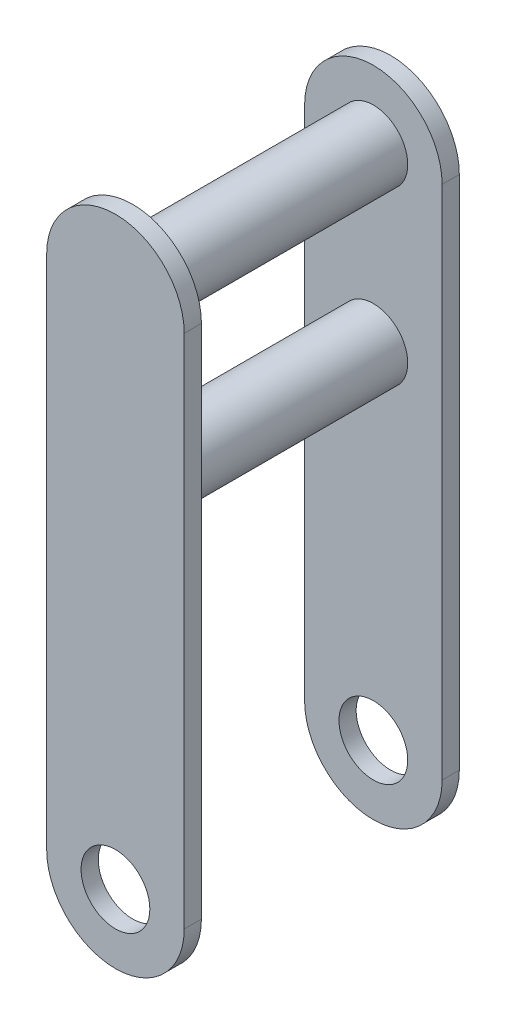
ISO-10303-21;
HEADER;
FILE_DESCRIPTION(('STEP AP214'),'2;1');
FILE_NAME('part.step','',(''),(''),'','','');
FILE_SCHEMA(('AUTOMOTIVE_DESIGN { 1 0 10303 214 1 1 1 1 }'));
ENDSEC;
DATA;
#1=APPLICATION_CONTEXT('core data for automotive mechanical design processes');
#2=APPLICATION_PROTOCOL_DEFINITION('international standard','automotive_design',2000,#1);
#3=PRODUCT_CONTEXT('',#1,'mechanical');
#4=PRODUCT('Part','Part','',(#3));
#5=PRODUCT_RELATED_PRODUCT_CATEGORY('part','',(#4));
#6=PRODUCT_DEFINITION_FORMATION('','',#4);
#7=PRODUCT_DEFINITION_CONTEXT('part definition',#1,'design');
#8=PRODUCT_DEFINITION('design','',#6,#7);
#9=PRODUCT_DEFINITION_SHAPE('','',#8);
#10=(LENGTH_UNIT() NAMED_UNIT(*) SI_UNIT(.MILLI.,.METRE.));
#11=(NAMED_UNIT(*) PLANE_ANGLE_UNIT() SI_UNIT($,.RADIAN.));
#12=(NAMED_UNIT(*) SI_UNIT($,.STERADIAN.) SOLID_ANGLE_UNIT());
#13=UNCERTAINTY_MEASURE_WITH_UNIT(LENGTH_MEASURE(1.E-05),#10,'distance_accuracy_value','');
#14=(GEOMETRIC_REPRESENTATION_CONTEXT(3) GLOBAL_UNCERTAINTY_ASSIGNED_CONTEXT((#13)) GLOBAL_UNIT_ASSIGNED_CONTEXT((#10,
#11,#12)) REPRESENTATION_CONTEXT('',''));
#15=CARTESIAN_POINT('',(0.,0.,0.));
#16=DIRECTION('',(0.,0.,1.));
#17=DIRECTION('',(1.,0.,0.));
#18=AXIS2_PLACEMENT_3D('',#15,#16,#17);
#19=CARTESIAN_POINT('',(0.,0.,80.));
#20=DIRECTION('',(0.,0.,1.));
#21=DIRECTION('',(1.,0.,0.));
#22=AXIS2_PLACEMENT_3D('',#19,#20,#21);
#23=PLANE('',#22);
#24=CARTESIAN_POINT('',(0.,0.,80.));
#25=DIRECTION('',(0.,0.,1.));
#26=DIRECTION('',(1.,0.,0.));
#27=AXIS2_PLACEMENT_3D('',#24,#25,#26);
#28=CIRCLE('',#27,40.);
#29=CARTESIAN_POINT('',(-40.,0.,80.));
#30=VERTEX_POINT('',#29);
#31=CARTESIAN_POINT('',(40.,0.,80.));
#32=VERTEX_POINT('',#31);
#33=EDGE_CURVE('E170',#30,#32,#28,.T.);
#34=ORIENTED_EDGE('',*,*,#33,.T.);
#35=DIRECTION('',(0.,1.,0.));
#36=VECTOR('',#35,1.);
#37=CARTESIAN_POINT('',(40.,0.,80.));
#38=LINE('',#37,#36);
#39=CARTESIAN_POINT('',(40.,300.,80.));
#40=VERTEX_POINT('',#39);
#41=EDGE_CURVE('E86',#32,#40,#38,.T.);
#42=ORIENTED_EDGE('',*,*,#41,.T.);
#43=CARTESIAN_POINT('',(0.,300.,80.));
#44=DIRECTION('',(0.,0.,1.));
#45=DIRECTION('',(1.,0.,0.));
#46=AXIS2_PLACEMENT_3D('',#43,#44,#45);
#47=CIRCLE('',#46,40.);
#48=CARTESIAN_POINT('',(-40.,300.,80.));
#49=VERTEX_POINT('',#48);
#50=EDGE_CURVE('E173',#40,#49,#47,.T.);
#51=ORIENTED_EDGE('',*,*,#50,.T.);
#52=DIRECTION('',(0.,-1.,0.));
#53=VECTOR('',#52,1.);
#54=CARTESIAN_POINT('',(-40.,0.,80.));
#55=LINE('',#54,#53);
#56=EDGE_CURVE('E54',#49,#30,#55,.T.);
#57=ORIENTED_EDGE('',*,*,#56,.T.);
#58=EDGE_LOOP('',(#34,#42,#51,#57));
#59=FACE_BOUND('',#58,.T.);
#60=CARTESIAN_POINT('',(0.,0.,80.));
#61=DIRECTION('',(0.,0.,1.));
#62=DIRECTION('',(1.,0.,0.));
#63=AXIS2_PLACEMENT_3D('',#60,#61,#62);
#64=CIRCLE('',#63,20.);
#65=CARTESIAN_POINT('',(20.,0.,80.));
#66=VERTEX_POINT('',#65);
#67=EDGE_CURVE('E164',#66,#66,#64,.T.);
#68=ORIENTED_EDGE('',*,*,#67,.F.);
#69=EDGE_LOOP('',(#68));
#70=FACE_BOUND('',#69,.T.);
#71=ADVANCED_FACE('F37',(#59,#70),#23,.T.);
#72=CARTESIAN_POINT('',(0.,0.,70.));
#73=DIRECTION('',(0.,0.,1.));
#74=DIRECTION('',(1.,0.,0.));
#75=AXIS2_PLACEMENT_3D('',#72,#73,#74);
#76=PLANE('',#75);
#77=CARTESIAN_POINT('',(0.,200.,70.));
#78=DIRECTION('',(0.,0.,1.));
#79=DIRECTION('',(1.,0.,0.));
#80=AXIS2_PLACEMENT_3D('',#77,#78,#79);
#81=CIRCLE('',#80,20.);
#82=CARTESIAN_POINT('',(20.,200.,70.));
#83=VERTEX_POINT('',#82);
#84=EDGE_CURVE('E11',#83,#83,#81,.F.);
#85=ORIENTED_EDGE('',*,*,#84,.F.);
#86=EDGE_LOOP('',(#85));
#87=FACE_BOUND('',#86,.T.);
#88=CARTESIAN_POINT('',(0.,300.,70.));
#89=DIRECTION('',(0.,0.,1.));
#90=DIRECTION('',(1.,0.,0.));
#91=AXIS2_PLACEMENT_3D('',#88,#89,#90);
#92=CIRCLE('',#91,20.);
#93=CARTESIAN_POINT('',(20.,300.,70.));
#94=VERTEX_POINT('',#93);
#95=EDGE_CURVE('E46',#94,#94,#92,.F.);
#96=ORIENTED_EDGE('',*,*,#95,.F.);
#97=EDGE_LOOP('',(#96));
#98=FACE_BOUND('',#97,.T.);
#99=CARTESIAN_POINT('',(0.,0.,70.));
#100=DIRECTION('',(0.,0.,1.));
#101=DIRECTION('',(1.,0.,0.));
#102=AXIS2_PLACEMENT_3D('',#99,#100,#101);
#103=CIRCLE('',#102,40.);
#104=CARTESIAN_POINT('',(-40.,0.,70.));
#105=VERTEX_POINT('',#104);
#106=CARTESIAN_POINT('',(40.,0.,70.));
#107=VERTEX_POINT('',#106);
#108=EDGE_CURVE('E167',#105,#107,#103,.T.);
#109=ORIENTED_EDGE('',*,*,#108,.F.);
#110=DIRECTION('',(0.,-1.,0.));
#111=VECTOR('',#110,1.);
#112=CARTESIAN_POINT('',(-40.,0.,70.));
#113=LINE('',#112,#111);
#114=CARTESIAN_POINT('',(-40.,300.,70.));
#115=VERTEX_POINT('',#114);
#116=EDGE_CURVE('E78',#115,#105,#113,.T.);
#117=ORIENTED_EDGE('',*,*,#116,.F.);
#118=CARTESIAN_POINT('',(0.,300.,70.));
#119=DIRECTION('',(0.,0.,1.));
#120=DIRECTION('',(1.,0.,0.));
#121=AXIS2_PLACEMENT_3D('',#118,#119,#120);
#122=CIRCLE('',#121,40.);
#123=CARTESIAN_POINT('',(40.,300.,70.));
#124=VERTEX_POINT('',#123);
#125=EDGE_CURVE('E72',#124,#115,#122,.T.);
#126=ORIENTED_EDGE('',*,*,#125,.F.);
#127=DIRECTION('',(0.,1.,0.));
#128=VECTOR('',#127,1.);
#129=CARTESIAN_POINT('',(40.,0.,70.));
#130=LINE('',#129,#128);
#131=EDGE_CURVE('E179',#107,#124,#130,.T.);
#132=ORIENTED_EDGE('',*,*,#131,.F.);
#133=EDGE_LOOP('',(#109,#117,#126,#132));
#134=FACE_BOUND('',#133,.T.);
#135=CARTESIAN_POINT('',(0.,0.,70.));
#136=DIRECTION('',(0.,0.,1.));
#137=DIRECTION('',(1.,0.,0.));
#138=AXIS2_PLACEMENT_3D('',#135,#136,#137);
#139=CIRCLE('',#138,20.);
#140=CARTESIAN_POINT('',(20.,0.,70.));
#141=VERTEX_POINT('',#140);
#142=EDGE_CURVE('E163',#141,#141,#139,.T.);
#143=ORIENTED_EDGE('',*,*,#142,.T.);
#144=EDGE_LOOP('',(#143));
#145=FACE_BOUND('',#144,.T.);
#146=ADVANCED_FACE('F194',(#87,#98,#134,#145),#76,.F.);
#147=CARTESIAN_POINT('',(0.,0.,80.));
#148=DIRECTION('',(0.,0.,-1.));
#149=DIRECTION('',(-1.,0.,0.));
#150=AXIS2_PLACEMENT_3D('',#147,#148,#149);
#151=CYLINDRICAL_SURFACE('',#150,40.);
#152=ORIENTED_EDGE('',*,*,#108,.T.);
#153=DIRECTION('',(0.,0.,-1.));
#154=VECTOR('',#153,1.);
#155=CARTESIAN_POINT('',(40.,0.,80.));
#156=LINE('',#155,#154);
#157=EDGE_CURVE('E188',#32,#107,#156,.T.);
#158=ORIENTED_EDGE('',*,*,#157,.F.);
#159=ORIENTED_EDGE('',*,*,#33,.F.);
#160=DIRECTION('',(0.,0.,-1.));
#161=VECTOR('',#160,1.);
#162=CARTESIAN_POINT('',(-40.,0.,80.));
#163=LINE('',#162,#161);
#164=EDGE_CURVE('E176',#30,#105,#163,.T.);
#165=ORIENTED_EDGE('',*,*,#164,.T.);
#166=EDGE_LOOP('',(#152,#158,#159,#165));
#167=FACE_BOUND('',#166,.T.);
#168=ADVANCED_FACE('F39',(#167),#151,.T.);
#169=CARTESIAN_POINT('',(40.,0.,80.));
#170=DIRECTION('',(-1.,0.,0.));
#171=DIRECTION('',(0.,0.,1.));
#172=AXIS2_PLACEMENT_3D('',#169,#170,#171);
#173=PLANE('',#172);
#174=ORIENTED_EDGE('',*,*,#131,.T.);
#175=DIRECTION('',(0.,0.,-1.));
#176=VECTOR('',#175,1.);
#177=CARTESIAN_POINT('',(40.,300.,80.));
#178=LINE('',#177,#176);
#179=EDGE_CURVE('E186',#40,#124,#178,.T.);
#180=ORIENTED_EDGE('',*,*,#179,.F.);
#181=ORIENTED_EDGE('',*,*,#41,.F.);
#182=ORIENTED_EDGE('',*,*,#157,.T.);
#183=EDGE_LOOP('',(#174,#180,#181,#182));
#184=FACE_BOUND('',#183,.T.);
#185=ADVANCED_FACE('F224',(#184),#173,.F.);
#186=CARTESIAN_POINT('',(0.,300.,80.));
#187=DIRECTION('',(0.,0.,-1.));
#188=DIRECTION('',(-1.,0.,0.));
#189=AXIS2_PLACEMENT_3D('',#186,#187,#188);
#190=CYLINDRICAL_SURFACE('',#189,40.);
#191=ORIENTED_EDGE('',*,*,#125,.T.);
#192=DIRECTION('',(0.,0.,-1.));
#193=VECTOR('',#192,1.);
#194=CARTESIAN_POINT('',(-40.,300.,80.));
#195=LINE('',#194,#193);
#196=EDGE_CURVE('E184',#49,#115,#195,.T.);
#197=ORIENTED_EDGE('',*,*,#196,.F.);
#198=ORIENTED_EDGE('',*,*,#50,.F.);
#199=ORIENTED_EDGE('',*,*,#179,.T.);
#200=EDGE_LOOP('',(#191,#197,#198,#199));
#201=FACE_BOUND('',#200,.T.);
#202=ADVANCED_FACE('F215',(#201),#190,.T.);
#203=CARTESIAN_POINT('',(-40.,0.,80.));
#204=DIRECTION('',(1.,0.,0.));
#205=DIRECTION('',(0.,0.,-1.));
#206=AXIS2_PLACEMENT_3D('',#203,#204,#205);
#207=PLANE('',#206);
#208=ORIENTED_EDGE('',*,*,#116,.T.);
#209=ORIENTED_EDGE('',*,*,#164,.F.);
#210=ORIENTED_EDGE('',*,*,#56,.F.);
#211=ORIENTED_EDGE('',*,*,#196,.T.);
#212=EDGE_LOOP('',(#208,#209,#210,#211));
#213=FACE_BOUND('',#212,.T.);
#214=ADVANCED_FACE('F205',(#213),#207,.F.);
#215=CARTESIAN_POINT('',(0.,0.,80.));
#216=DIRECTION('',(0.,0.,-1.));
#217=DIRECTION('',(-1.,0.,0.));
#218=AXIS2_PLACEMENT_3D('',#215,#216,#217);
#219=CYLINDRICAL_SURFACE('',#218,20.);
#220=ORIENTED_EDGE('',*,*,#67,.T.);
#221=EDGE_LOOP('',(#220));
#222=FACE_BOUND('',#221,.T.);
#223=ORIENTED_EDGE('',*,*,#142,.F.);
#224=EDGE_LOOP('',(#223));
#225=FACE_BOUND('',#224,.T.);
#226=ADVANCED_FACE('F203',(#222,#225),#219,.F.);
#227=CARTESIAN_POINT('',(0.,300.,-70.));
#228=DIRECTION('',(0.,0.,1.));
#229=DIRECTION('',(1.,0.,0.));
#230=AXIS2_PLACEMENT_3D('',#227,#228,#229);
#231=CYLINDRICAL_SURFACE('',#230,20.);
#232=CARTESIAN_POINT('',(0.,300.,-70.));
#233=DIRECTION('',(0.,0.,-1.));
#234=DIRECTION('',(-1.,0.,0.));
#235=AXIS2_PLACEMENT_3D('',#232,#233,#234);
#236=CIRCLE('',#235,20.);
#237=CARTESIAN_POINT('',(-20.,300.,-70.));
#238=VERTEX_POINT('',#237);
#239=EDGE_CURVE('E160',#238,#238,#236,.T.);
#240=ORIENTED_EDGE('',*,*,#239,.F.);
#241=EDGE_LOOP('',(#240));
#242=FACE_BOUND('',#241,.T.);
#243=ORIENTED_EDGE('',*,*,#95,.T.);
#244=EDGE_LOOP('',(#243));
#245=FACE_BOUND('',#244,.T.);
#246=ADVANCED_FACE('F192',(#242,#245),#231,.T.);
#247=CARTESIAN_POINT('',(0.,200.,-70.));
#248=DIRECTION('',(0.,0.,1.));
#249=DIRECTION('',(1.,0.,0.));
#250=AXIS2_PLACEMENT_3D('',#247,#248,#249);
#251=CYLINDRICAL_SURFACE('',#250,20.);
#252=CARTESIAN_POINT('',(0.,200.,-70.));
#253=DIRECTION('',(0.,0.,-1.));
#254=DIRECTION('',(-1.,0.,0.));
#255=AXIS2_PLACEMENT_3D('',#252,#253,#254);
#256=CIRCLE('',#255,20.);
#257=CARTESIAN_POINT('',(-20.,200.,-70.));
#258=VERTEX_POINT('',#257);
#259=EDGE_CURVE('E124',#258,#258,#256,.T.);
#260=ORIENTED_EDGE('',*,*,#259,.F.);
#261=EDGE_LOOP('',(#260));
#262=FACE_BOUND('',#261,.T.);
#263=ORIENTED_EDGE('',*,*,#84,.T.);
#264=EDGE_LOOP('',(#263));
#265=FACE_BOUND('',#264,.T.);
#266=ADVANCED_FACE('F212',(#262,#265),#251,.T.);
#267=CARTESIAN_POINT('',(0.,0.,-80.));
#268=DIRECTION('',(0.,0.,1.));
#269=DIRECTION('',(1.,0.,0.));
#270=AXIS2_PLACEMENT_3D('',#267,#268,#269);
#271=CYLINDRICAL_SURFACE('',#270,40.);
#272=CARTESIAN_POINT('',(0.,0.,-70.));
#273=DIRECTION('',(0.,0.,1.));
#274=DIRECTION('',(1.,0.,0.));
#275=AXIS2_PLACEMENT_3D('',#272,#273,#274);
#276=CIRCLE('',#275,40.);
#277=CARTESIAN_POINT('',(-40.,0.,-70.));
#278=VERTEX_POINT('',#277);
#279=CARTESIAN_POINT('',(40.,0.,-70.));
#280=VERTEX_POINT('',#279);
#281=EDGE_CURVE('E119',#278,#280,#276,.T.);
#282=ORIENTED_EDGE('',*,*,#281,.F.);
#283=DIRECTION('',(0.,0.,1.));
#284=VECTOR('',#283,1.);
#285=CARTESIAN_POINT('',(-40.,0.,-80.));
#286=LINE('',#285,#284);
#287=CARTESIAN_POINT('',(-40.,0.,-80.));
#288=VERTEX_POINT('',#287);
#289=EDGE_CURVE('E113',#288,#278,#286,.T.);
#290=ORIENTED_EDGE('',*,*,#289,.F.);
#291=CARTESIAN_POINT('',(0.,0.,-80.));
#292=DIRECTION('',(0.,0.,1.));
#293=DIRECTION('',(1.,0.,0.));
#294=AXIS2_PLACEMENT_3D('',#291,#292,#293);
#295=CIRCLE('',#294,40.);
#296=CARTESIAN_POINT('',(40.,0.,-80.));
#297=VERTEX_POINT('',#296);
#298=EDGE_CURVE('E116',#288,#297,#295,.T.);
#299=ORIENTED_EDGE('',*,*,#298,.T.);
#300=DIRECTION('',(0.,0.,1.));
#301=VECTOR('',#300,1.);
#302=CARTESIAN_POINT('',(40.,0.,-80.));
#303=LINE('',#302,#301);
#304=EDGE_CURVE('E144',#297,#280,#303,.T.);
#305=ORIENTED_EDGE('',*,*,#304,.T.);
#306=EDGE_LOOP('',(#282,#290,#299,#305));
#307=FACE_BOUND('',#306,.T.);
#308=ADVANCED_FACE('F115',(#307),#271,.T.);
#309=CARTESIAN_POINT('',(-40.,0.,-80.));
#310=DIRECTION('',(-1.,0.,0.));
#311=DIRECTION('',(0.,0.,1.));
#312=AXIS2_PLACEMENT_3D('',#309,#310,#311);
#313=PLANE('',#312);
#314=DIRECTION('',(0.,-1.,0.));
#315=VECTOR('',#314,1.);
#316=CARTESIAN_POINT('',(-40.,0.,-70.));
#317=LINE('',#316,#315);
#318=CARTESIAN_POINT('',(-40.,300.,-70.));
#319=VERTEX_POINT('',#318);
#320=EDGE_CURVE('E146',#319,#278,#317,.T.);
#321=ORIENTED_EDGE('',*,*,#320,.F.);
#322=DIRECTION('',(0.,0.,1.));
#323=VECTOR('',#322,1.);
#324=CARTESIAN_POINT('',(-40.,300.,-80.));
#325=LINE('',#324,#323);
#326=CARTESIAN_POINT('',(-40.,300.,-80.));
#327=VERTEX_POINT('',#326);
#328=EDGE_CURVE('E125',#327,#319,#325,.T.);
#329=ORIENTED_EDGE('',*,*,#328,.F.);
#330=DIRECTION('',(0.,-1.,0.));
#331=VECTOR('',#330,1.);
#332=CARTESIAN_POINT('',(-40.,0.,-80.));
#333=LINE('',#332,#331);
#334=EDGE_CURVE('E131',#327,#288,#333,.T.);
#335=ORIENTED_EDGE('',*,*,#334,.T.);
#336=ORIENTED_EDGE('',*,*,#289,.T.);
#337=EDGE_LOOP('',(#321,#329,#335,#336));
#338=FACE_BOUND('',#337,.T.);
#339=ADVANCED_FACE('F137',(#338),#313,.T.);
#340=CARTESIAN_POINT('',(0.,300.,-80.));
#341=DIRECTION('',(0.,0.,1.));
#342=DIRECTION('',(1.,0.,0.));
#343=AXIS2_PLACEMENT_3D('',#340,#341,#342);
#344=CYLINDRICAL_SURFACE('',#343,40.);
#345=CARTESIAN_POINT('',(0.,300.,-70.));
#346=DIRECTION('',(0.,0.,1.));
#347=DIRECTION('',(1.,0.,0.));
#348=AXIS2_PLACEMENT_3D('',#345,#346,#347);
#349=CIRCLE('',#348,40.);
#350=CARTESIAN_POINT('',(40.,300.,-70.));
#351=VERTEX_POINT('',#350);
#352=EDGE_CURVE('E149',#351,#319,#349,.T.);
#353=ORIENTED_EDGE('',*,*,#352,.F.);
#354=DIRECTION('',(0.,0.,1.));
#355=VECTOR('',#354,1.);
#356=CARTESIAN_POINT('',(40.,300.,-80.));
#357=LINE('',#356,#355);
#358=CARTESIAN_POINT('',(40.,300.,-80.));
#359=VERTEX_POINT('',#358);
#360=EDGE_CURVE('E155',#359,#351,#357,.T.);
#361=ORIENTED_EDGE('',*,*,#360,.F.);
#362=CARTESIAN_POINT('',(0.,300.,-80.));
#363=DIRECTION('',(0.,0.,1.));
#364=DIRECTION('',(1.,0.,0.));
#365=AXIS2_PLACEMENT_3D('',#362,#363,#364);
#366=CIRCLE('',#365,40.);
#367=EDGE_CURVE('E138',#359,#327,#366,.T.);
#368=ORIENTED_EDGE('',*,*,#367,.T.);
#369=ORIENTED_EDGE('',*,*,#328,.T.);
#370=EDGE_LOOP('',(#353,#361,#368,#369));
#371=FACE_BOUND('',#370,.T.);
#372=ADVANCED_FACE('F279',(#371),#344,.T.);
#373=CARTESIAN_POINT('',(40.,0.,-80.));
#374=DIRECTION('',(1.,0.,0.));
#375=DIRECTION('',(0.,0.,-1.));
#376=AXIS2_PLACEMENT_3D('',#373,#374,#375);
#377=PLANE('',#376);
#378=DIRECTION('',(0.,1.,0.));
#379=VECTOR('',#378,1.);
#380=CARTESIAN_POINT('',(40.,0.,-70.));
#381=LINE('',#380,#379);
#382=EDGE_CURVE('E135',#280,#351,#381,.T.);
#383=ORIENTED_EDGE('',*,*,#382,.F.);
#384=ORIENTED_EDGE('',*,*,#304,.F.);
#385=DIRECTION('',(0.,1.,0.));
#386=VECTOR('',#385,1.);
#387=CARTESIAN_POINT('',(40.,0.,-80.));
#388=LINE('',#387,#386);
#389=EDGE_CURVE('E134',#297,#359,#388,.T.);
#390=ORIENTED_EDGE('',*,*,#389,.T.);
#391=ORIENTED_EDGE('',*,*,#360,.T.);
#392=EDGE_LOOP('',(#383,#384,#390,#391));
#393=FACE_BOUND('',#392,.T.);
#394=ADVANCED_FACE('F289',(#393),#377,.T.);
#395=CARTESIAN_POINT('',(0.,0.,-80.));
#396=DIRECTION('',(0.,0.,-1.));
#397=DIRECTION('',(1.,0.,0.));
#398=AXIS2_PLACEMENT_3D('',#395,#396,#397);
#399=PLANE('',#398);
#400=CARTESIAN_POINT('',(0.,0.,-80.));
#401=DIRECTION('',(0.,0.,1.));
#402=DIRECTION('',(1.,0.,0.));
#403=AXIS2_PLACEMENT_3D('',#400,#401,#402);
#404=CIRCLE('',#403,20.);
#405=CARTESIAN_POINT('',(20.,0.,-80.));
#406=VERTEX_POINT('',#405);
#407=EDGE_CURVE('E147',#406,#406,#404,.T.);
#408=ORIENTED_EDGE('',*,*,#407,.T.);
#409=EDGE_LOOP('',(#408));
#410=FACE_BOUND('',#409,.T.);
#411=ORIENTED_EDGE('',*,*,#298,.F.);
#412=ORIENTED_EDGE('',*,*,#334,.F.);
#413=ORIENTED_EDGE('',*,*,#367,.F.);
#414=ORIENTED_EDGE('',*,*,#389,.F.);
#415=EDGE_LOOP('',(#411,#412,#413,#414));
#416=FACE_BOUND('',#415,.T.);
#417=ADVANCED_FACE('F129',(#410,#416),#399,.T.);
#418=CARTESIAN_POINT('',(0.,0.,-70.));
#419=DIRECTION('',(0.,0.,-1.));
#420=DIRECTION('',(1.,0.,0.));
#421=AXIS2_PLACEMENT_3D('',#418,#419,#420);
#422=PLANE('',#421);
#423=ORIENTED_EDGE('',*,*,#239,.T.);
#424=EDGE_LOOP('',(#423));
#425=FACE_BOUND('',#424,.T.);
#426=ORIENTED_EDGE('',*,*,#259,.T.);
#427=EDGE_LOOP('',(#426));
#428=FACE_BOUND('',#427,.T.);
#429=CARTESIAN_POINT('',(0.,0.,-70.));
#430=DIRECTION('',(0.,0.,1.));
#431=DIRECTION('',(1.,0.,0.));
#432=AXIS2_PLACEMENT_3D('',#429,#430,#431);
#433=CIRCLE('',#432,20.);
#434=CARTESIAN_POINT('',(20.,0.,-70.));
#435=VERTEX_POINT('',#434);
#436=EDGE_CURVE('E386',#435,#435,#433,.T.);
#437=ORIENTED_EDGE('',*,*,#436,.F.);
#438=EDGE_LOOP('',(#437));
#439=FACE_BOUND('',#438,.T.);
#440=ORIENTED_EDGE('',*,*,#281,.T.);
#441=ORIENTED_EDGE('',*,*,#382,.T.);
#442=ORIENTED_EDGE('',*,*,#352,.T.);
#443=ORIENTED_EDGE('',*,*,#320,.T.);
#444=EDGE_LOOP('',(#440,#441,#442,#443));
#445=FACE_BOUND('',#444,.T.);
#446=ADVANCED_FACE('F310',(#425,#428,#439,#445),#422,.F.);
#447=CARTESIAN_POINT('',(0.,0.,-80.));
#448=DIRECTION('',(0.,0.,1.));
#449=DIRECTION('',(1.,0.,0.));
#450=AXIS2_PLACEMENT_3D('',#447,#448,#449);
#451=CYLINDRICAL_SURFACE('',#450,20.);
#452=ORIENTED_EDGE('',*,*,#407,.F.);
#453=EDGE_LOOP('',(#452));
#454=FACE_BOUND('',#453,.T.);
#455=ORIENTED_EDGE('',*,*,#436,.T.);
#456=EDGE_LOOP('',(#455));
#457=FACE_BOUND('',#456,.T.);
#458=ADVANCED_FACE('F321',(#454,#457),#451,.F.);
#459=CLOSED_SHELL('',(#71,#146,#168,#185,#202,#214,#226,#246,#266,#308,#339,#372,#394,#417,#446,#458));
#460=MANIFOLD_SOLID_BREP('B2',#459);
#461=ADVANCED_BREP_SHAPE_REPRESENTATION('',(#18,#460),#14);
#462=SHAPE_DEFINITION_REPRESENTATION(#9,#461);
ENDSEC;
END-ISO-10303-21;
